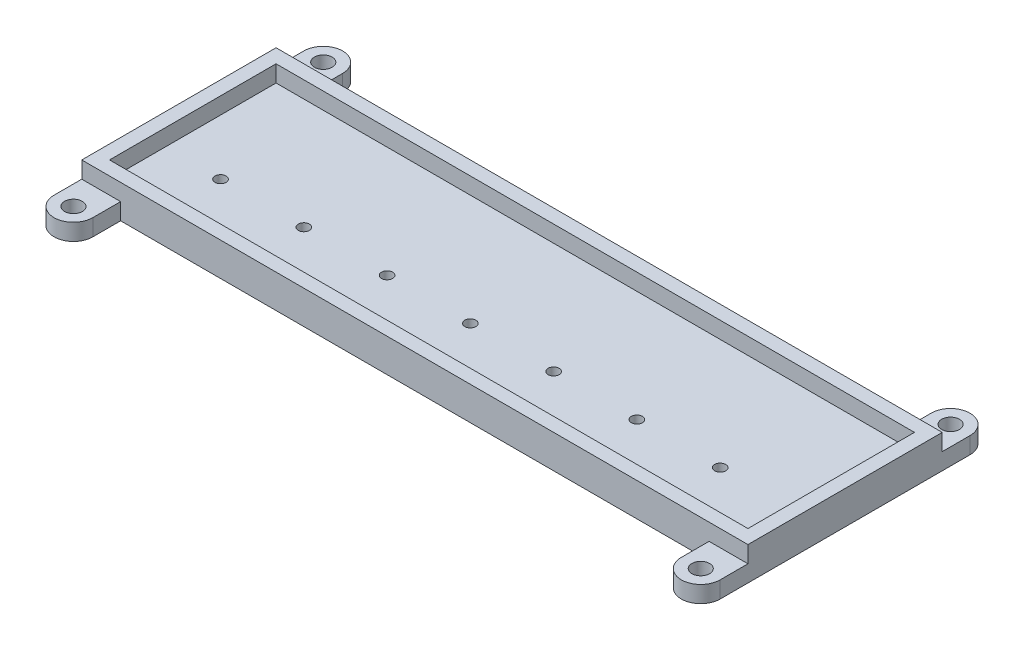
ISO-10303-21;
HEADER;
FILE_DESCRIPTION(('STEP AP214'),'2;1');
FILE_NAME('part.step','',(''),(''),'','','');
FILE_SCHEMA(('AUTOMOTIVE_DESIGN { 1 0 10303 214 1 1 1 1 }'));
ENDSEC;
DATA;
#1=APPLICATION_CONTEXT('core data for automotive mechanical design processes');
#2=APPLICATION_PROTOCOL_DEFINITION('international standard','automotive_design',2000,#1);
#3=PRODUCT_CONTEXT('',#1,'mechanical');
#4=PRODUCT('Part','Part','',(#3));
#5=PRODUCT_RELATED_PRODUCT_CATEGORY('part','',(#4));
#6=PRODUCT_DEFINITION_FORMATION('','',#4);
#7=PRODUCT_DEFINITION_CONTEXT('part definition',#1,'design');
#8=PRODUCT_DEFINITION('design','',#6,#7);
#9=PRODUCT_DEFINITION_SHAPE('','',#8);
#10=(LENGTH_UNIT() NAMED_UNIT(*) SI_UNIT(.MILLI.,.METRE.));
#11=(NAMED_UNIT(*) PLANE_ANGLE_UNIT() SI_UNIT($,.RADIAN.));
#12=(NAMED_UNIT(*) SI_UNIT($,.STERADIAN.) SOLID_ANGLE_UNIT());
#13=UNCERTAINTY_MEASURE_WITH_UNIT(LENGTH_MEASURE(1.E-05),#10,'distance_accuracy_value','');
#14=(GEOMETRIC_REPRESENTATION_CONTEXT(3) GLOBAL_UNCERTAINTY_ASSIGNED_CONTEXT((#13)) GLOBAL_UNIT_ASSIGNED_CONTEXT((#10,
#11,#12)) REPRESENTATION_CONTEXT('',''));
#15=CARTESIAN_POINT('',(0.,0.,0.));
#16=DIRECTION('',(0.,0.,1.));
#17=DIRECTION('',(1.,0.,0.));
#18=AXIS2_PLACEMENT_3D('',#15,#16,#17);
#19=CARTESIAN_POINT('',(117.5,134.,-32.5));
#20=DIRECTION('',(0.,0.,1.));
#21=DIRECTION('',(1.,0.,0.));
#22=AXIS2_PLACEMENT_3D('',#19,#20,#21);
#23=PLANE('',#22);
#24=DIRECTION('',(0.,-1.,0.));
#25=VECTOR('',#24,1.);
#26=CARTESIAN_POINT('',(117.5,134.,-32.5));
#27=LINE('',#26,#25);
#28=CARTESIAN_POINT('',(117.5,6.00000000000001,-32.5));
#29=VERTEX_POINT('',#28);
#30=CARTESIAN_POINT('',(117.5,3.,-32.5));
#31=VERTEX_POINT('',#30);
#32=EDGE_CURVE('E321',#29,#31,#27,.T.);
#33=ORIENTED_EDGE('',*,*,#32,.T.);
#34=DIRECTION('',(1.,0.,0.));
#35=VECTOR('',#34,1.);
#36=CARTESIAN_POINT('',(110.5,3.,-32.5));
#37=LINE('',#36,#35);
#38=CARTESIAN_POINT('',(110.5,3.,-32.5));
#39=VERTEX_POINT('',#38);
#40=EDGE_CURVE('E210',#39,#31,#37,.T.);
#41=ORIENTED_EDGE('',*,*,#40,.F.);
#42=DIRECTION('',(0.,-1.,0.));
#43=VECTOR('',#42,1.);
#44=CARTESIAN_POINT('',(110.5,3.,-32.5));
#45=LINE('',#44,#43);
#46=CARTESIAN_POINT('',(110.5,0.,-32.5));
#47=VERTEX_POINT('',#46);
#48=EDGE_CURVE('E221',#39,#47,#45,.T.);
#49=ORIENTED_EDGE('',*,*,#48,.T.);
#50=DIRECTION('',(-1.,0.,0.));
#51=VECTOR('',#50,1.);
#52=CARTESIAN_POINT('',(117.5,0.,-32.5));
#53=LINE('',#52,#51);
#54=CARTESIAN_POINT('',(4.5,0.,-32.5));
#55=VERTEX_POINT('',#54);
#56=EDGE_CURVE('E318',#47,#55,#53,.T.);
#57=ORIENTED_EDGE('',*,*,#56,.T.);
#58=DIRECTION('',(0.,-1.,0.));
#59=VECTOR('',#58,1.);
#60=CARTESIAN_POINT('',(4.5,3.,-32.5));
#61=LINE('',#60,#59);
#62=CARTESIAN_POINT('',(4.5,3.,-32.5));
#63=VERTEX_POINT('',#62);
#64=EDGE_CURVE('E262',#63,#55,#61,.T.);
#65=ORIENTED_EDGE('',*,*,#64,.F.);
#66=DIRECTION('',(-1.,0.,0.));
#67=VECTOR('',#66,1.);
#68=CARTESIAN_POINT('',(4.5,3.,-32.5));
#69=LINE('',#68,#67);
#70=CARTESIAN_POINT('',(-2.5,3.,-32.5));
#71=VERTEX_POINT('',#70);
#72=EDGE_CURVE('E240',#63,#71,#69,.T.);
#73=ORIENTED_EDGE('',*,*,#72,.T.);
#74=DIRECTION('',(0.,-1.,0.));
#75=VECTOR('',#74,1.);
#76=CARTESIAN_POINT('',(-2.5,134.,-32.5));
#77=LINE('',#76,#75);
#78=CARTESIAN_POINT('',(-2.5,6.00000000000001,-32.5));
#79=VERTEX_POINT('',#78);
#80=EDGE_CURVE('E317',#79,#71,#77,.T.);
#81=ORIENTED_EDGE('',*,*,#80,.F.);
#82=DIRECTION('',(1.,0.,0.));
#83=VECTOR('',#82,1.);
#84=CARTESIAN_POINT('',(117.5,6.00000000000001,-32.5));
#85=LINE('',#84,#83);
#86=EDGE_CURVE('E305',#79,#29,#85,.T.);
#87=ORIENTED_EDGE('',*,*,#86,.T.);
#88=EDGE_LOOP('',(#33,#41,#49,#57,#65,#73,#81,#87));
#89=FACE_BOUND('',#88,.T.);
#90=ADVANCED_FACE('F35',(#89),#23,.F.);
#91=CARTESIAN_POINT('',(-2.5,134.,2.5));
#92=DIRECTION('',(0.,0.,-1.));
#93=DIRECTION('',(-1.,0.,0.));
#94=AXIS2_PLACEMENT_3D('',#91,#92,#93);
#95=PLANE('',#94);
#96=DIRECTION('',(1.,0.,0.));
#97=VECTOR('',#96,1.);
#98=CARTESIAN_POINT('',(-2.5,0.,2.5));
#99=LINE('',#98,#97);
#100=CARTESIAN_POINT('',(4.5,0.,2.5));
#101=VERTEX_POINT('',#100);
#102=CARTESIAN_POINT('',(110.5,0.,2.5));
#103=VERTEX_POINT('',#102);
#104=EDGE_CURVE('E310',#101,#103,#99,.T.);
#105=ORIENTED_EDGE('',*,*,#104,.T.);
#106=DIRECTION('',(0.,-1.,0.));
#107=VECTOR('',#106,1.);
#108=CARTESIAN_POINT('',(110.5,3.,2.5));
#109=LINE('',#108,#107);
#110=CARTESIAN_POINT('',(110.5,3.,2.5));
#111=VERTEX_POINT('',#110);
#112=EDGE_CURVE('E50',#111,#103,#109,.T.);
#113=ORIENTED_EDGE('',*,*,#112,.F.);
#114=DIRECTION('',(1.,0.,0.));
#115=VECTOR('',#114,1.);
#116=CARTESIAN_POINT('',(110.5,3.,2.5));
#117=LINE('',#116,#115);
#118=CARTESIAN_POINT('',(117.5,3.,2.5));
#119=VERTEX_POINT('',#118);
#120=EDGE_CURVE('E54',#111,#119,#117,.T.);
#121=ORIENTED_EDGE('',*,*,#120,.T.);
#122=DIRECTION('',(0.,-1.,0.));
#123=VECTOR('',#122,1.);
#124=CARTESIAN_POINT('',(117.5,134.,2.5));
#125=LINE('',#124,#123);
#126=CARTESIAN_POINT('',(117.5,6.00000000000001,2.5));
#127=VERTEX_POINT('',#126);
#128=EDGE_CURVE('E309',#127,#119,#125,.T.);
#129=ORIENTED_EDGE('',*,*,#128,.F.);
#130=DIRECTION('',(-1.,0.,0.));
#131=VECTOR('',#130,1.);
#132=CARTESIAN_POINT('',(-2.5,6.00000000000001,2.5));
#133=LINE('',#132,#131);
#134=CARTESIAN_POINT('',(-2.5,6.00000000000001,2.5));
#135=VERTEX_POINT('',#134);
#136=EDGE_CURVE('E316',#127,#135,#133,.T.);
#137=ORIENTED_EDGE('',*,*,#136,.T.);
#138=DIRECTION('',(0.,-1.,0.));
#139=VECTOR('',#138,1.);
#140=CARTESIAN_POINT('',(-2.5,134.,2.5));
#141=LINE('',#140,#139);
#142=CARTESIAN_POINT('',(-2.5,3.,2.5));
#143=VERTEX_POINT('',#142);
#144=EDGE_CURVE('E313',#135,#143,#141,.T.);
#145=ORIENTED_EDGE('',*,*,#144,.T.);
#146=DIRECTION('',(-1.,0.,0.));
#147=VECTOR('',#146,1.);
#148=CARTESIAN_POINT('',(4.5,3.,2.5));
#149=LINE('',#148,#147);
#150=CARTESIAN_POINT('',(4.5,3.,2.5));
#151=VERTEX_POINT('',#150);
#152=EDGE_CURVE('E272',#151,#143,#149,.T.);
#153=ORIENTED_EDGE('',*,*,#152,.F.);
#154=DIRECTION('',(0.,-1.,0.));
#155=VECTOR('',#154,1.);
#156=CARTESIAN_POINT('',(4.5,3.,2.5));
#157=LINE('',#156,#155);
#158=EDGE_CURVE('E282',#151,#101,#157,.T.);
#159=ORIENTED_EDGE('',*,*,#158,.T.);
#160=EDGE_LOOP('',(#105,#113,#121,#129,#137,#145,#153,#159));
#161=FACE_BOUND('',#160,.T.);
#162=ADVANCED_FACE('F398',(#161),#95,.F.);
#163=CARTESIAN_POINT('',(100.,0.,-10.));
#164=DIRECTION('',(0.,1.,0.));
#165=DIRECTION('',(0.,0.,1.));
#166=AXIS2_PLACEMENT_3D('',#163,#164,#165);
#167=CYLINDRICAL_SURFACE('',#166,1.);
#168=CARTESIAN_POINT('',(100.,0.,-10.));
#169=DIRECTION('',(0.,1.,0.));
#170=DIRECTION('',(0.,0.,1.));
#171=AXIS2_PLACEMENT_3D('',#168,#169,#170);
#172=CIRCLE('',#171,1.);
#173=CARTESIAN_POINT('',(100.,0.,-9.));
#174=VERTEX_POINT('',#173);
#175=EDGE_CURVE('E43',#174,#174,#172,.T.);
#176=ORIENTED_EDGE('',*,*,#175,.F.);
#177=EDGE_LOOP('',(#176));
#178=FACE_BOUND('',#177,.T.);
#179=CARTESIAN_POINT('',(100.,3.,-10.));
#180=DIRECTION('',(0.,-1.,0.));
#181=DIRECTION('',(0.,0.,-1.));
#182=AXIS2_PLACEMENT_3D('',#179,#180,#181);
#183=CIRCLE('',#182,1.);
#184=CARTESIAN_POINT('',(100.,3.,-11.));
#185=VERTEX_POINT('',#184);
#186=EDGE_CURVE('E12',#185,#185,#183,.T.);
#187=ORIENTED_EDGE('',*,*,#186,.F.);
#188=EDGE_LOOP('',(#187));
#189=FACE_BOUND('',#188,.T.);
#190=ADVANCED_FACE('F37',(#178,#189),#167,.F.);
#191=CARTESIAN_POINT('',(85.,0.,-10.));
#192=DIRECTION('',(0.,1.,0.));
#193=DIRECTION('',(0.,0.,1.));
#194=AXIS2_PLACEMENT_3D('',#191,#192,#193);
#195=CYLINDRICAL_SURFACE('',#194,1.);
#196=CARTESIAN_POINT('',(85.,0.,-10.));
#197=DIRECTION('',(0.,1.,0.));
#198=DIRECTION('',(0.,0.,1.));
#199=AXIS2_PLACEMENT_3D('',#196,#197,#198);
#200=CIRCLE('',#199,1.);
#201=CARTESIAN_POINT('',(85.,0.,-9.));
#202=VERTEX_POINT('',#201);
#203=EDGE_CURVE('E384',#202,#202,#200,.T.);
#204=ORIENTED_EDGE('',*,*,#203,.F.);
#205=EDGE_LOOP('',(#204));
#206=FACE_BOUND('',#205,.T.);
#207=CARTESIAN_POINT('',(85.,3.,-10.));
#208=DIRECTION('',(0.,-1.,0.));
#209=DIRECTION('',(0.,0.,-1.));
#210=AXIS2_PLACEMENT_3D('',#207,#208,#209);
#211=CIRCLE('',#210,1.);
#212=CARTESIAN_POINT('',(85.,3.,-11.));
#213=VERTEX_POINT('',#212);
#214=EDGE_CURVE('E387',#213,#213,#211,.T.);
#215=ORIENTED_EDGE('',*,*,#214,.F.);
#216=EDGE_LOOP('',(#215));
#217=FACE_BOUND('',#216,.T.);
#218=ADVANCED_FACE('F397',(#206,#217),#195,.F.);
#219=CARTESIAN_POINT('',(70.,0.,-10.));
#220=DIRECTION('',(0.,1.,0.));
#221=DIRECTION('',(0.,0.,1.));
#222=AXIS2_PLACEMENT_3D('',#219,#220,#221);
#223=CYLINDRICAL_SURFACE('',#222,1.);
#224=CARTESIAN_POINT('',(70.,0.,-10.));
#225=DIRECTION('',(0.,1.,0.));
#226=DIRECTION('',(0.,0.,1.));
#227=AXIS2_PLACEMENT_3D('',#224,#225,#226);
#228=CIRCLE('',#227,1.);
#229=CARTESIAN_POINT('',(70.,0.,-9.));
#230=VERTEX_POINT('',#229);
#231=EDGE_CURVE('E378',#230,#230,#228,.T.);
#232=ORIENTED_EDGE('',*,*,#231,.F.);
#233=EDGE_LOOP('',(#232));
#234=FACE_BOUND('',#233,.T.);
#235=CARTESIAN_POINT('',(70.,3.,-10.));
#236=DIRECTION('',(0.,-1.,0.));
#237=DIRECTION('',(0.,0.,-1.));
#238=AXIS2_PLACEMENT_3D('',#235,#236,#237);
#239=CIRCLE('',#238,1.);
#240=CARTESIAN_POINT('',(70.,3.,-11.));
#241=VERTEX_POINT('',#240);
#242=EDGE_CURVE('E381',#241,#241,#239,.T.);
#243=ORIENTED_EDGE('',*,*,#242,.F.);
#244=EDGE_LOOP('',(#243));
#245=FACE_BOUND('',#244,.T.);
#246=ADVANCED_FACE('F558',(#234,#245),#223,.F.);
#247=CARTESIAN_POINT('',(55.,0.,-10.));
#248=DIRECTION('',(0.,1.,0.));
#249=DIRECTION('',(0.,0.,1.));
#250=AXIS2_PLACEMENT_3D('',#247,#248,#249);
#251=CYLINDRICAL_SURFACE('',#250,1.);
#252=CARTESIAN_POINT('',(55.,0.,-10.));
#253=DIRECTION('',(0.,1.,0.));
#254=DIRECTION('',(0.,0.,1.));
#255=AXIS2_PLACEMENT_3D('',#252,#253,#254);
#256=CIRCLE('',#255,1.);
#257=CARTESIAN_POINT('',(55.,0.,-9.));
#258=VERTEX_POINT('',#257);
#259=EDGE_CURVE('E372',#258,#258,#256,.T.);
#260=ORIENTED_EDGE('',*,*,#259,.F.);
#261=EDGE_LOOP('',(#260));
#262=FACE_BOUND('',#261,.T.);
#263=CARTESIAN_POINT('',(55.,3.,-10.));
#264=DIRECTION('',(0.,-1.,0.));
#265=DIRECTION('',(0.,0.,-1.));
#266=AXIS2_PLACEMENT_3D('',#263,#264,#265);
#267=CIRCLE('',#266,1.);
#268=CARTESIAN_POINT('',(55.,3.,-11.));
#269=VERTEX_POINT('',#268);
#270=EDGE_CURVE('E375',#269,#269,#267,.T.);
#271=ORIENTED_EDGE('',*,*,#270,.F.);
#272=EDGE_LOOP('',(#271));
#273=FACE_BOUND('',#272,.T.);
#274=ADVANCED_FACE('F414',(#262,#273),#251,.F.);
#275=CARTESIAN_POINT('',(40.,0.,-10.));
#276=DIRECTION('',(0.,1.,0.));
#277=DIRECTION('',(0.,0.,1.));
#278=AXIS2_PLACEMENT_3D('',#275,#276,#277);
#279=CYLINDRICAL_SURFACE('',#278,1.);
#280=CARTESIAN_POINT('',(40.,0.,-10.));
#281=DIRECTION('',(0.,1.,0.));
#282=DIRECTION('',(0.,0.,1.));
#283=AXIS2_PLACEMENT_3D('',#280,#281,#282);
#284=CIRCLE('',#283,1.);
#285=CARTESIAN_POINT('',(40.,0.,-9.));
#286=VERTEX_POINT('',#285);
#287=EDGE_CURVE('E366',#286,#286,#284,.T.);
#288=ORIENTED_EDGE('',*,*,#287,.F.);
#289=EDGE_LOOP('',(#288));
#290=FACE_BOUND('',#289,.T.);
#291=CARTESIAN_POINT('',(40.,3.,-10.));
#292=DIRECTION('',(0.,-1.,0.));
#293=DIRECTION('',(0.,0.,-1.));
#294=AXIS2_PLACEMENT_3D('',#291,#292,#293);
#295=CIRCLE('',#294,1.);
#296=CARTESIAN_POINT('',(40.,3.,-11.));
#297=VERTEX_POINT('',#296);
#298=EDGE_CURVE('E369',#297,#297,#295,.T.);
#299=ORIENTED_EDGE('',*,*,#298,.F.);
#300=EDGE_LOOP('',(#299));
#301=FACE_BOUND('',#300,.T.);
#302=ADVANCED_FACE('F404',(#290,#301),#279,.F.);
#303=CARTESIAN_POINT('',(0.,3.,0.));
#304=DIRECTION('',(0.,-1.,0.));
#305=DIRECTION('',(0.,0.,-1.));
#306=AXIS2_PLACEMENT_3D('',#303,#304,#305);
#307=PLANE('',#306);
#308=CARTESIAN_POINT('',(25.,3.,-10.));
#309=DIRECTION('',(0.,-1.,0.));
#310=DIRECTION('',(0.,0.,-1.));
#311=AXIS2_PLACEMENT_3D('',#308,#309,#310);
#312=CIRCLE('',#311,1.);
#313=CARTESIAN_POINT('',(25.,3.,-11.));
#314=VERTEX_POINT('',#313);
#315=EDGE_CURVE('E296',#314,#314,#312,.T.);
#316=ORIENTED_EDGE('',*,*,#315,.T.);
#317=EDGE_LOOP('',(#316));
#318=FACE_BOUND('',#317,.T.);
#319=CARTESIAN_POINT('',(10.,3.,-10.));
#320=DIRECTION('',(0.,-1.,0.));
#321=DIRECTION('',(0.,0.,-1.));
#322=AXIS2_PLACEMENT_3D('',#319,#320,#321);
#323=CIRCLE('',#322,1.);
#324=CARTESIAN_POINT('',(10.,3.,-11.));
#325=VERTEX_POINT('',#324);
#326=EDGE_CURVE('E302',#325,#325,#323,.T.);
#327=ORIENTED_EDGE('',*,*,#326,.T.);
#328=EDGE_LOOP('',(#327));
#329=FACE_BOUND('',#328,.T.);
#330=DIRECTION('',(0.,0.,1.));
#331=VECTOR('',#330,1.);
#332=CARTESIAN_POINT('',(0.,3.,0.));
#333=LINE('',#332,#331);
#334=CARTESIAN_POINT('',(0.,3.,-30.));
#335=VERTEX_POINT('',#334);
#336=CARTESIAN_POINT('',(0.,3.,0.));
#337=VERTEX_POINT('',#336);
#338=EDGE_CURVE('E353',#335,#337,#333,.T.);
#339=ORIENTED_EDGE('',*,*,#338,.T.);
#340=DIRECTION('',(1.,0.,0.));
#341=VECTOR('',#340,1.);
#342=CARTESIAN_POINT('',(0.,3.,0.));
#343=LINE('',#342,#341);
#344=CARTESIAN_POINT('',(115.,3.,0.));
#345=VERTEX_POINT('',#344);
#346=EDGE_CURVE('E357',#337,#345,#343,.T.);
#347=ORIENTED_EDGE('',*,*,#346,.T.);
#348=DIRECTION('',(0.,0.,-1.));
#349=VECTOR('',#348,1.);
#350=CARTESIAN_POINT('',(115.,3.,0.));
#351=LINE('',#350,#349);
#352=CARTESIAN_POINT('',(115.,3.,-30.));
#353=VERTEX_POINT('',#352);
#354=EDGE_CURVE('E360',#345,#353,#351,.T.);
#355=ORIENTED_EDGE('',*,*,#354,.T.);
#356=DIRECTION('',(-1.,0.,0.));
#357=VECTOR('',#356,1.);
#358=CARTESIAN_POINT('',(0.,3.,-30.));
#359=LINE('',#358,#357);
#360=EDGE_CURVE('E363',#353,#335,#359,.T.);
#361=ORIENTED_EDGE('',*,*,#360,.T.);
#362=EDGE_LOOP('',(#339,#347,#355,#361));
#363=FACE_BOUND('',#362,.T.);
#364=ORIENTED_EDGE('',*,*,#298,.T.);
#365=EDGE_LOOP('',(#364));
#366=FACE_BOUND('',#365,.T.);
#367=ORIENTED_EDGE('',*,*,#270,.T.);
#368=EDGE_LOOP('',(#367));
#369=FACE_BOUND('',#368,.T.);
#370=ORIENTED_EDGE('',*,*,#242,.T.);
#371=EDGE_LOOP('',(#370));
#372=FACE_BOUND('',#371,.T.);
#373=ORIENTED_EDGE('',*,*,#214,.T.);
#374=EDGE_LOOP('',(#373));
#375=FACE_BOUND('',#374,.T.);
#376=ORIENTED_EDGE('',*,*,#186,.T.);
#377=EDGE_LOOP('',(#376));
#378=FACE_BOUND('',#377,.T.);
#379=ADVANCED_FACE('F401',(#318,#329,#363,#366,#369,#372,#375,#378),#307,.F.);
#380=CARTESIAN_POINT('',(115.,134.,-30.));
#381=DIRECTION('',(0.,0.,1.));
#382=DIRECTION('',(1.,0.,0.));
#383=AXIS2_PLACEMENT_3D('',#380,#381,#382);
#384=PLANE('',#383);
#385=ORIENTED_EDGE('',*,*,#360,.F.);
#386=DIRECTION('',(0.,-1.,0.));
#387=VECTOR('',#386,1.);
#388=CARTESIAN_POINT('',(115.,134.,-30.));
#389=LINE('',#388,#387);
#390=CARTESIAN_POINT('',(115.,6.00000000000001,-30.));
#391=VERTEX_POINT('',#390);
#392=EDGE_CURVE('E340',#391,#353,#389,.T.);
#393=ORIENTED_EDGE('',*,*,#392,.F.);
#394=DIRECTION('',(1.,0.,0.));
#395=VECTOR('',#394,1.);
#396=CARTESIAN_POINT('',(115.,6.00000000000001,-30.));
#397=LINE('',#396,#395);
#398=CARTESIAN_POINT('',(0.,6.00000000000001,-30.));
#399=VERTEX_POINT('',#398);
#400=EDGE_CURVE('E325',#399,#391,#397,.T.);
#401=ORIENTED_EDGE('',*,*,#400,.F.);
#402=DIRECTION('',(0.,-1.,0.));
#403=VECTOR('',#402,1.);
#404=CARTESIAN_POINT('',(0.,134.,-30.));
#405=LINE('',#404,#403);
#406=EDGE_CURVE('E308',#399,#335,#405,.T.);
#407=ORIENTED_EDGE('',*,*,#406,.T.);
#408=EDGE_LOOP('',(#385,#393,#401,#407));
#409=FACE_BOUND('',#408,.T.);
#410=ADVANCED_FACE('F403',(#409),#384,.T.);
#411=CARTESIAN_POINT('',(0.,134.,-30.));
#412=DIRECTION('',(1.,0.,0.));
#413=DIRECTION('',(0.,0.,-1.));
#414=AXIS2_PLACEMENT_3D('',#411,#412,#413);
#415=PLANE('',#414);
#416=ORIENTED_EDGE('',*,*,#338,.F.);
#417=ORIENTED_EDGE('',*,*,#406,.F.);
#418=DIRECTION('',(0.,0.,-1.));
#419=VECTOR('',#418,1.);
#420=CARTESIAN_POINT('',(0.,6.00000000000001,-30.));
#421=LINE('',#420,#419);
#422=CARTESIAN_POINT('',(0.,6.00000000000001,0.));
#423=VERTEX_POINT('',#422);
#424=EDGE_CURVE('E351',#423,#399,#421,.T.);
#425=ORIENTED_EDGE('',*,*,#424,.F.);
#426=DIRECTION('',(0.,-1.,0.));
#427=VECTOR('',#426,1.);
#428=CARTESIAN_POINT('',(0.,134.,0.));
#429=LINE('',#428,#427);
#430=EDGE_CURVE('E334',#423,#337,#429,.T.);
#431=ORIENTED_EDGE('',*,*,#430,.T.);
#432=EDGE_LOOP('',(#416,#417,#425,#431));
#433=FACE_BOUND('',#432,.T.);
#434=ADVANCED_FACE('F411',(#433),#415,.T.);
#435=CARTESIAN_POINT('',(0.,134.,0.));
#436=DIRECTION('',(0.,0.,-1.));
#437=DIRECTION('',(-1.,0.,0.));
#438=AXIS2_PLACEMENT_3D('',#435,#436,#437);
#439=PLANE('',#438);
#440=ORIENTED_EDGE('',*,*,#346,.F.);
#441=ORIENTED_EDGE('',*,*,#430,.F.);
#442=DIRECTION('',(-1.,0.,0.));
#443=VECTOR('',#442,1.);
#444=CARTESIAN_POINT('',(0.,6.00000000000001,0.));
#445=LINE('',#444,#443);
#446=CARTESIAN_POINT('',(115.,6.00000000000001,0.));
#447=VERTEX_POINT('',#446);
#448=EDGE_CURVE('E324',#447,#423,#445,.T.);
#449=ORIENTED_EDGE('',*,*,#448,.F.);
#450=DIRECTION('',(0.,-1.,0.));
#451=VECTOR('',#450,1.);
#452=CARTESIAN_POINT('',(115.,134.,0.));
#453=LINE('',#452,#451);
#454=EDGE_CURVE('E337',#447,#345,#453,.T.);
#455=ORIENTED_EDGE('',*,*,#454,.T.);
#456=EDGE_LOOP('',(#440,#441,#449,#455));
#457=FACE_BOUND('',#456,.T.);
#458=ADVANCED_FACE('F433',(#457),#439,.T.);
#459=CARTESIAN_POINT('',(115.,134.,0.));
#460=DIRECTION('',(-1.,0.,0.));
#461=DIRECTION('',(0.,0.,1.));
#462=AXIS2_PLACEMENT_3D('',#459,#460,#461);
#463=PLANE('',#462);
#464=ORIENTED_EDGE('',*,*,#354,.F.);
#465=ORIENTED_EDGE('',*,*,#454,.F.);
#466=DIRECTION('',(0.,0.,1.));
#467=VECTOR('',#466,1.);
#468=CARTESIAN_POINT('',(115.,6.00000000000001,0.));
#469=LINE('',#468,#467);
#470=EDGE_CURVE('E322',#391,#447,#469,.T.);
#471=ORIENTED_EDGE('',*,*,#470,.F.);
#472=ORIENTED_EDGE('',*,*,#392,.T.);
#473=EDGE_LOOP('',(#464,#465,#471,#472));
#474=FACE_BOUND('',#473,.T.);
#475=ADVANCED_FACE('F430',(#474),#463,.T.);
#476=CARTESIAN_POINT('',(-2.5,134.,-32.5));
#477=DIRECTION('',(1.,0.,0.));
#478=DIRECTION('',(0.,0.,-1.));
#479=AXIS2_PLACEMENT_3D('',#476,#477,#478);
#480=PLANE('',#479);
#481=ORIENTED_EDGE('',*,*,#144,.F.);
#482=DIRECTION('',(0.,0.,-1.));
#483=VECTOR('',#482,1.);
#484=CARTESIAN_POINT('',(-2.5,6.00000000000001,-32.5));
#485=LINE('',#484,#483);
#486=EDGE_CURVE('E320',#135,#79,#485,.T.);
#487=ORIENTED_EDGE('',*,*,#486,.T.);
#488=ORIENTED_EDGE('',*,*,#80,.T.);
#489=DIRECTION('',(0.,0.,-1.));
#490=VECTOR('',#489,1.);
#491=CARTESIAN_POINT('',(-2.5,3.,-32.5));
#492=LINE('',#491,#490);
#493=CARTESIAN_POINT('',(-2.5,3.,-37.5));
#494=VERTEX_POINT('',#493);
#495=EDGE_CURVE('E250',#71,#494,#492,.T.);
#496=ORIENTED_EDGE('',*,*,#495,.T.);
#497=DIRECTION('',(0.,-1.,0.));
#498=VECTOR('',#497,1.);
#499=CARTESIAN_POINT('',(-2.5,3.,-37.5));
#500=LINE('',#499,#498);
#501=CARTESIAN_POINT('',(-2.5,0.,-37.5));
#502=VERTEX_POINT('',#501);
#503=EDGE_CURVE('E253',#494,#502,#500,.T.);
#504=ORIENTED_EDGE('',*,*,#503,.T.);
#505=DIRECTION('',(0.,0.,1.));
#506=VECTOR('',#505,1.);
#507=CARTESIAN_POINT('',(-2.5,0.,-32.5));
#508=LINE('',#507,#506);
#509=CARTESIAN_POINT('',(-2.5,0.,7.5));
#510=VERTEX_POINT('',#509);
#511=EDGE_CURVE('E314',#502,#510,#508,.T.);
#512=ORIENTED_EDGE('',*,*,#511,.T.);
#513=DIRECTION('',(0.,-1.,0.));
#514=VECTOR('',#513,1.);
#515=CARTESIAN_POINT('',(-2.5,3.,7.5));
#516=LINE('',#515,#514);
#517=CARTESIAN_POINT('',(-2.5,3.,7.5));
#518=VERTEX_POINT('',#517);
#519=EDGE_CURVE('E290',#518,#510,#516,.T.);
#520=ORIENTED_EDGE('',*,*,#519,.F.);
#521=DIRECTION('',(0.,0.,1.));
#522=VECTOR('',#521,1.);
#523=CARTESIAN_POINT('',(-2.5,3.,2.5));
#524=LINE('',#523,#522);
#525=EDGE_CURVE('E275',#143,#518,#524,.T.);
#526=ORIENTED_EDGE('',*,*,#525,.F.);
#527=EDGE_LOOP('',(#481,#487,#488,#496,#504,#512,#520,#526));
#528=FACE_BOUND('',#527,.T.);
#529=ADVANCED_FACE('F429',(#528),#480,.F.);
#530=CARTESIAN_POINT('',(117.5,134.,2.5));
#531=DIRECTION('',(-1.,0.,0.));
#532=DIRECTION('',(0.,0.,1.));
#533=AXIS2_PLACEMENT_3D('',#530,#531,#532);
#534=PLANE('',#533);
#535=ORIENTED_EDGE('',*,*,#32,.F.);
#536=DIRECTION('',(0.,0.,1.));
#537=VECTOR('',#536,1.);
#538=CARTESIAN_POINT('',(117.5,6.00000000000001,2.5));
#539=LINE('',#538,#537);
#540=EDGE_CURVE('E312',#29,#127,#539,.T.);
#541=ORIENTED_EDGE('',*,*,#540,.T.);
#542=ORIENTED_EDGE('',*,*,#128,.T.);
#543=DIRECTION('',(0.,0.,1.));
#544=VECTOR('',#543,1.);
#545=CARTESIAN_POINT('',(117.5,3.,2.5));
#546=LINE('',#545,#544);
#547=CARTESIAN_POINT('',(117.5,3.,7.5));
#548=VERTEX_POINT('',#547);
#549=EDGE_CURVE('E192',#119,#548,#546,.T.);
#550=ORIENTED_EDGE('',*,*,#549,.T.);
#551=DIRECTION('',(0.,-1.,0.));
#552=VECTOR('',#551,1.);
#553=CARTESIAN_POINT('',(117.5,3.,7.5));
#554=LINE('',#553,#552);
#555=CARTESIAN_POINT('',(117.5,0.,7.5));
#556=VERTEX_POINT('',#555);
#557=EDGE_CURVE('E181',#548,#556,#554,.T.);
#558=ORIENTED_EDGE('',*,*,#557,.T.);
#559=DIRECTION('',(0.,0.,-1.));
#560=VECTOR('',#559,1.);
#561=CARTESIAN_POINT('',(117.5,0.,2.5));
#562=LINE('',#561,#560);
#563=CARTESIAN_POINT('',(117.5,0.,-37.5));
#564=VERTEX_POINT('',#563);
#565=EDGE_CURVE('E306',#556,#564,#562,.T.);
#566=ORIENTED_EDGE('',*,*,#565,.T.);
#567=DIRECTION('',(0.,-1.,0.));
#568=VECTOR('',#567,1.);
#569=CARTESIAN_POINT('',(117.5,3.,-37.5));
#570=LINE('',#569,#568);
#571=CARTESIAN_POINT('',(117.5,3.,-37.5));
#572=VERTEX_POINT('',#571);
#573=EDGE_CURVE('E230',#572,#564,#570,.T.);
#574=ORIENTED_EDGE('',*,*,#573,.F.);
#575=DIRECTION('',(0.,0.,-1.));
#576=VECTOR('',#575,1.);
#577=CARTESIAN_POINT('',(117.5,3.,-32.5));
#578=LINE('',#577,#576);
#579=EDGE_CURVE('E213',#31,#572,#578,.T.);
#580=ORIENTED_EDGE('',*,*,#579,.F.);
#581=EDGE_LOOP('',(#535,#541,#542,#550,#558,#566,#574,#580));
#582=FACE_BOUND('',#581,.T.);
#583=ADVANCED_FACE('F442',(#582),#534,.F.);
#584=CARTESIAN_POINT('',(0.,6.,0.));
#585=DIRECTION('',(0.,-1.,0.));
#586=DIRECTION('',(0.,0.,-1.));
#587=AXIS2_PLACEMENT_3D('',#584,#585,#586);
#588=PLANE('',#587);
#589=ORIENTED_EDGE('',*,*,#400,.T.);
#590=ORIENTED_EDGE('',*,*,#470,.T.);
#591=ORIENTED_EDGE('',*,*,#448,.T.);
#592=ORIENTED_EDGE('',*,*,#424,.T.);
#593=EDGE_LOOP('',(#589,#590,#591,#592));
#594=FACE_BOUND('',#593,.T.);
#595=ORIENTED_EDGE('',*,*,#486,.F.);
#596=ORIENTED_EDGE('',*,*,#136,.F.);
#597=ORIENTED_EDGE('',*,*,#540,.F.);
#598=ORIENTED_EDGE('',*,*,#86,.F.);
#599=EDGE_LOOP('',(#595,#596,#597,#598));
#600=FACE_BOUND('',#599,.T.);
#601=ADVANCED_FACE('F440',(#594,#600),#588,.F.);
#602=CARTESIAN_POINT('',(0.,0.,0.));
#603=DIRECTION('',(0.,-1.,0.));
#604=DIRECTION('',(0.,0.,-1.));
#605=AXIS2_PLACEMENT_3D('',#602,#603,#604);
#606=PLANE('',#605);
#607=CARTESIAN_POINT('',(25.,0.,-10.));
#608=DIRECTION('',(0.,1.,0.));
#609=DIRECTION('',(0.,0.,1.));
#610=AXIS2_PLACEMENT_3D('',#607,#608,#609);
#611=CIRCLE('',#610,1.);
#612=CARTESIAN_POINT('',(25.,0.,-9.));
#613=VERTEX_POINT('',#612);
#614=EDGE_CURVE('E293',#613,#613,#611,.T.);
#615=ORIENTED_EDGE('',*,*,#614,.T.);
#616=EDGE_LOOP('',(#615));
#617=FACE_BOUND('',#616,.T.);
#618=CARTESIAN_POINT('',(10.,0.,-10.));
#619=DIRECTION('',(0.,1.,0.));
#620=DIRECTION('',(0.,0.,1.));
#621=AXIS2_PLACEMENT_3D('',#618,#619,#620);
#622=CIRCLE('',#621,1.);
#623=CARTESIAN_POINT('',(10.,0.,-9.));
#624=VERTEX_POINT('',#623);
#625=EDGE_CURVE('E299',#624,#624,#622,.T.);
#626=ORIENTED_EDGE('',*,*,#625,.T.);
#627=EDGE_LOOP('',(#626));
#628=FACE_BOUND('',#627,.T.);
#629=ORIENTED_EDGE('',*,*,#56,.F.);
#630=DIRECTION('',(0.,0.,1.));
#631=VECTOR('',#630,1.);
#632=CARTESIAN_POINT('',(110.5,0.,-32.5));
#633=LINE('',#632,#631);
#634=CARTESIAN_POINT('',(110.5,0.,-37.5));
#635=VERTEX_POINT('',#634);
#636=EDGE_CURVE('E214',#635,#47,#633,.T.);
#637=ORIENTED_EDGE('',*,*,#636,.F.);
#638=CARTESIAN_POINT('',(114.,0.,-37.5));
#639=DIRECTION('',(0.,1.,0.));
#640=DIRECTION('',(0.,0.,-1.));
#641=AXIS2_PLACEMENT_3D('',#638,#639,#640);
#642=CIRCLE('',#641,3.5);
#643=EDGE_CURVE('E207',#564,#635,#642,.T.);
#644=ORIENTED_EDGE('',*,*,#643,.F.);
#645=ORIENTED_EDGE('',*,*,#565,.F.);
#646=CARTESIAN_POINT('',(114.,0.,7.5));
#647=DIRECTION('',(0.,-1.,0.));
#648=DIRECTION('',(0.,0.,1.));
#649=AXIS2_PLACEMENT_3D('',#646,#647,#648);
#650=CIRCLE('',#649,3.5);
#651=CARTESIAN_POINT('',(110.5,0.,7.5));
#652=VERTEX_POINT('',#651);
#653=EDGE_CURVE('E198',#556,#652,#650,.T.);
#654=ORIENTED_EDGE('',*,*,#653,.T.);
#655=DIRECTION('',(0.,0.,-1.));
#656=VECTOR('',#655,1.);
#657=CARTESIAN_POINT('',(110.5,0.,2.5));
#658=LINE('',#657,#656);
#659=EDGE_CURVE('E176',#652,#103,#658,.T.);
#660=ORIENTED_EDGE('',*,*,#659,.T.);
#661=ORIENTED_EDGE('',*,*,#104,.F.);
#662=DIRECTION('',(0.,0.,-1.));
#663=VECTOR('',#662,1.);
#664=CARTESIAN_POINT('',(4.5,0.,2.5));
#665=LINE('',#664,#663);
#666=CARTESIAN_POINT('',(4.5,0.,7.5));
#667=VERTEX_POINT('',#666);
#668=EDGE_CURVE('E276',#667,#101,#665,.T.);
#669=ORIENTED_EDGE('',*,*,#668,.F.);
#670=CARTESIAN_POINT('',(1.,0.,7.5));
#671=DIRECTION('',(0.,1.,0.));
#672=DIRECTION('',(0.,0.,1.));
#673=AXIS2_PLACEMENT_3D('',#670,#671,#672);
#674=CIRCLE('',#673,3.5);
#675=EDGE_CURVE('E269',#510,#667,#674,.T.);
#676=ORIENTED_EDGE('',*,*,#675,.F.);
#677=ORIENTED_EDGE('',*,*,#511,.F.);
#678=CARTESIAN_POINT('',(1.,0.,-37.5));
#679=DIRECTION('',(0.,-1.,0.));
#680=DIRECTION('',(0.,0.,-1.));
#681=AXIS2_PLACEMENT_3D('',#678,#679,#680);
#682=CIRCLE('',#681,3.5);
#683=CARTESIAN_POINT('',(4.5,0.,-37.5));
#684=VERTEX_POINT('',#683);
#685=EDGE_CURVE('E244',#502,#684,#682,.T.);
#686=ORIENTED_EDGE('',*,*,#685,.T.);
#687=DIRECTION('',(0.,0.,1.));
#688=VECTOR('',#687,1.);
#689=CARTESIAN_POINT('',(4.5,0.,-32.5));
#690=LINE('',#689,#688);
#691=EDGE_CURVE('E237',#684,#55,#690,.T.);
#692=ORIENTED_EDGE('',*,*,#691,.T.);
#693=EDGE_LOOP('',(#629,#637,#644,#645,#654,#660,#661,#669,#676,#677,#686,#692));
#694=FACE_BOUND('',#693,.T.);
#695=ORIENTED_EDGE('',*,*,#287,.T.);
#696=EDGE_LOOP('',(#695));
#697=FACE_BOUND('',#696,.T.);
#698=ORIENTED_EDGE('',*,*,#259,.T.);
#699=EDGE_LOOP('',(#698));
#700=FACE_BOUND('',#699,.T.);
#701=ORIENTED_EDGE('',*,*,#231,.T.);
#702=EDGE_LOOP('',(#701));
#703=FACE_BOUND('',#702,.T.);
#704=ORIENTED_EDGE('',*,*,#203,.T.);
#705=EDGE_LOOP('',(#704));
#706=FACE_BOUND('',#705,.T.);
#707=ORIENTED_EDGE('',*,*,#175,.T.);
#708=EDGE_LOOP('',(#707));
#709=FACE_BOUND('',#708,.T.);
#710=CARTESIAN_POINT('',(1.,0.,7.5));
#711=DIRECTION('',(0.,1.,0.));
#712=DIRECTION('',(0.,0.,1.));
#713=AXIS2_PLACEMENT_3D('',#710,#711,#712);
#714=CIRCLE('',#713,1.6);
#715=CARTESIAN_POINT('',(1.,0.,9.1));
#716=VERTEX_POINT('',#715);
#717=EDGE_CURVE('E265',#716,#716,#714,.T.);
#718=ORIENTED_EDGE('',*,*,#717,.T.);
#719=EDGE_LOOP('',(#718));
#720=FACE_BOUND('',#719,.T.);
#721=CARTESIAN_POINT('',(1.,0.,-37.5));
#722=DIRECTION('',(0.,-1.,0.));
#723=DIRECTION('',(0.,0.,-1.));
#724=AXIS2_PLACEMENT_3D('',#721,#722,#723);
#725=CIRCLE('',#724,1.6);
#726=CARTESIAN_POINT('',(1.,0.,-39.1));
#727=VERTEX_POINT('',#726);
#728=EDGE_CURVE('E233',#727,#727,#725,.T.);
#729=ORIENTED_EDGE('',*,*,#728,.F.);
#730=EDGE_LOOP('',(#729));
#731=FACE_BOUND('',#730,.T.);
#732=CARTESIAN_POINT('',(114.,0.,-37.5));
#733=DIRECTION('',(0.,1.,0.));
#734=DIRECTION('',(0.,0.,-1.));
#735=AXIS2_PLACEMENT_3D('',#732,#733,#734);
#736=CIRCLE('',#735,1.6);
#737=CARTESIAN_POINT('',(114.,0.,-39.1));
#738=VERTEX_POINT('',#737);
#739=EDGE_CURVE('E203',#738,#738,#736,.T.);
#740=ORIENTED_EDGE('',*,*,#739,.T.);
#741=EDGE_LOOP('',(#740));
#742=FACE_BOUND('',#741,.T.);
#743=CARTESIAN_POINT('',(114.,0.,7.5));
#744=DIRECTION('',(0.,-1.,0.));
#745=DIRECTION('',(0.,0.,1.));
#746=AXIS2_PLACEMENT_3D('',#743,#744,#745);
#747=CIRCLE('',#746,1.6);
#748=CARTESIAN_POINT('',(114.,0.,9.1));
#749=VERTEX_POINT('',#748);
#750=EDGE_CURVE('E744',#749,#749,#747,.T.);
#751=ORIENTED_EDGE('',*,*,#750,.F.);
#752=EDGE_LOOP('',(#751));
#753=FACE_BOUND('',#752,.T.);
#754=ADVANCED_FACE('F392',(#617,#628,#694,#697,#700,#703,#706,#709,#720,#731,#742,#753),#606,.T.);
#755=CARTESIAN_POINT('',(10.,0.,-10.));
#756=DIRECTION('',(0.,1.,0.));
#757=DIRECTION('',(0.,0.,1.));
#758=AXIS2_PLACEMENT_3D('',#755,#756,#757);
#759=CYLINDRICAL_SURFACE('',#758,1.);
#760=ORIENTED_EDGE('',*,*,#625,.F.);
#761=EDGE_LOOP('',(#760));
#762=FACE_BOUND('',#761,.T.);
#763=ORIENTED_EDGE('',*,*,#326,.F.);
#764=EDGE_LOOP('',(#763));
#765=FACE_BOUND('',#764,.T.);
#766=ADVANCED_FACE('F448',(#762,#765),#759,.F.);
#767=CARTESIAN_POINT('',(25.,0.,-10.));
#768=DIRECTION('',(0.,1.,0.));
#769=DIRECTION('',(0.,0.,1.));
#770=AXIS2_PLACEMENT_3D('',#767,#768,#769);
#771=CYLINDRICAL_SURFACE('',#770,1.);
#772=ORIENTED_EDGE('',*,*,#614,.F.);
#773=EDGE_LOOP('',(#772));
#774=FACE_BOUND('',#773,.T.);
#775=ORIENTED_EDGE('',*,*,#315,.F.);
#776=EDGE_LOOP('',(#775));
#777=FACE_BOUND('',#776,.T.);
#778=ADVANCED_FACE('F532',(#774,#777),#771,.F.);
#779=CARTESIAN_POINT('',(1.,3.,7.5));
#780=DIRECTION('',(0.,1.,0.));
#781=DIRECTION('',(0.,0.,1.));
#782=AXIS2_PLACEMENT_3D('',#779,#780,#781);
#783=PLANE('',#782);
#784=ORIENTED_EDGE('',*,*,#152,.T.);
#785=ORIENTED_EDGE('',*,*,#525,.T.);
#786=CARTESIAN_POINT('',(1.,3.,7.5));
#787=DIRECTION('',(0.,1.,0.));
#788=DIRECTION('',(0.,0.,1.));
#789=AXIS2_PLACEMENT_3D('',#786,#787,#788);
#790=CIRCLE('',#789,3.5);
#791=CARTESIAN_POINT('',(4.5,3.,7.5));
#792=VERTEX_POINT('',#791);
#793=EDGE_CURVE('E278',#518,#792,#790,.T.);
#794=ORIENTED_EDGE('',*,*,#793,.T.);
#795=DIRECTION('',(0.,0.,-1.));
#796=VECTOR('',#795,1.);
#797=CARTESIAN_POINT('',(4.5,3.,2.5));
#798=LINE('',#797,#796);
#799=EDGE_CURVE('E280',#792,#151,#798,.T.);
#800=ORIENTED_EDGE('',*,*,#799,.T.);
#801=EDGE_LOOP('',(#784,#785,#794,#800));
#802=FACE_BOUND('',#801,.T.);
#803=CARTESIAN_POINT('',(1.,3.,7.5));
#804=DIRECTION('',(0.,1.,0.));
#805=DIRECTION('',(0.,0.,1.));
#806=AXIS2_PLACEMENT_3D('',#803,#804,#805);
#807=CIRCLE('',#806,1.6);
#808=CARTESIAN_POINT('',(1.,3.,9.1));
#809=VERTEX_POINT('',#808);
#810=EDGE_CURVE('E266',#809,#809,#807,.T.);
#811=ORIENTED_EDGE('',*,*,#810,.F.);
#812=EDGE_LOOP('',(#811));
#813=FACE_BOUND('',#812,.T.);
#814=ADVANCED_FACE('F481',(#802,#813),#783,.T.);
#815=CARTESIAN_POINT('',(1.,3.,7.5));
#816=DIRECTION('',(0.,-1.,0.));
#817=DIRECTION('',(0.,0.,-1.));
#818=AXIS2_PLACEMENT_3D('',#815,#816,#817);
#819=CYLINDRICAL_SURFACE('',#818,3.5);
#820=ORIENTED_EDGE('',*,*,#675,.T.);
#821=DIRECTION('',(0.,-1.,0.));
#822=VECTOR('',#821,1.);
#823=CARTESIAN_POINT('',(4.5,3.,7.5));
#824=LINE('',#823,#822);
#825=EDGE_CURVE('E287',#792,#667,#824,.T.);
#826=ORIENTED_EDGE('',*,*,#825,.F.);
#827=ORIENTED_EDGE('',*,*,#793,.F.);
#828=ORIENTED_EDGE('',*,*,#519,.T.);
#829=EDGE_LOOP('',(#820,#826,#827,#828));
#830=FACE_BOUND('',#829,.T.);
#831=ADVANCED_FACE('F477',(#830),#819,.T.);
#832=CARTESIAN_POINT('',(4.5,3.,2.5));
#833=DIRECTION('',(-1.,0.,0.));
#834=DIRECTION('',(0.,0.,1.));
#835=AXIS2_PLACEMENT_3D('',#832,#833,#834);
#836=PLANE('',#835);
#837=ORIENTED_EDGE('',*,*,#668,.T.);
#838=ORIENTED_EDGE('',*,*,#158,.F.);
#839=ORIENTED_EDGE('',*,*,#799,.F.);
#840=ORIENTED_EDGE('',*,*,#825,.T.);
#841=EDGE_LOOP('',(#837,#838,#839,#840));
#842=FACE_BOUND('',#841,.T.);
#843=ADVANCED_FACE('F528',(#842),#836,.F.);
#844=CARTESIAN_POINT('',(1.,3.,7.5));
#845=DIRECTION('',(0.,-1.,0.));
#846=DIRECTION('',(0.,0.,-1.));
#847=AXIS2_PLACEMENT_3D('',#844,#845,#846);
#848=CYLINDRICAL_SURFACE('',#847,1.6);
#849=ORIENTED_EDGE('',*,*,#810,.T.);
#850=EDGE_LOOP('',(#849));
#851=FACE_BOUND('',#850,.T.);
#852=ORIENTED_EDGE('',*,*,#717,.F.);
#853=EDGE_LOOP('',(#852));
#854=FACE_BOUND('',#853,.T.);
#855=ADVANCED_FACE('F524',(#851,#854),#848,.F.);
#856=CARTESIAN_POINT('',(4.5,3.,-32.5));
#857=DIRECTION('',(1.,0.,0.));
#858=DIRECTION('',(0.,0.,-1.));
#859=AXIS2_PLACEMENT_3D('',#856,#857,#858);
#860=PLANE('',#859);
#861=ORIENTED_EDGE('',*,*,#691,.F.);
#862=DIRECTION('',(0.,-1.,0.));
#863=VECTOR('',#862,1.);
#864=CARTESIAN_POINT('',(4.5,3.,-37.5));
#865=LINE('',#864,#863);
#866=CARTESIAN_POINT('',(4.5,3.,-37.5));
#867=VERTEX_POINT('',#866);
#868=EDGE_CURVE('E260',#867,#684,#865,.T.);
#869=ORIENTED_EDGE('',*,*,#868,.F.);
#870=DIRECTION('',(0.,0.,1.));
#871=VECTOR('',#870,1.);
#872=CARTESIAN_POINT('',(4.5,3.,-32.5));
#873=LINE('',#872,#871);
#874=EDGE_CURVE('E243',#867,#63,#873,.T.);
#875=ORIENTED_EDGE('',*,*,#874,.T.);
#876=ORIENTED_EDGE('',*,*,#64,.T.);
#877=EDGE_LOOP('',(#861,#869,#875,#876));
#878=FACE_BOUND('',#877,.T.);
#879=ADVANCED_FACE('F521',(#878),#860,.T.);
#880=CARTESIAN_POINT('',(1.,3.,-37.5));
#881=DIRECTION('',(0.,-1.,0.));
#882=DIRECTION('',(0.,0.,-1.));
#883=AXIS2_PLACEMENT_3D('',#880,#881,#882);
#884=CYLINDRICAL_SURFACE('',#883,3.5);
#885=ORIENTED_EDGE('',*,*,#685,.F.);
#886=ORIENTED_EDGE('',*,*,#503,.F.);
#887=CARTESIAN_POINT('',(1.,3.,-37.5));
#888=DIRECTION('',(0.,-1.,0.));
#889=DIRECTION('',(0.,0.,-1.));
#890=AXIS2_PLACEMENT_3D('',#887,#888,#889);
#891=CIRCLE('',#890,3.5);
#892=EDGE_CURVE('E247',#494,#867,#891,.T.);
#893=ORIENTED_EDGE('',*,*,#892,.T.);
#894=ORIENTED_EDGE('',*,*,#868,.T.);
#895=EDGE_LOOP('',(#885,#886,#893,#894));
#896=FACE_BOUND('',#895,.T.);
#897=ADVANCED_FACE('F469',(#896),#884,.T.);
#898=CARTESIAN_POINT('',(1.,3.,-37.5));
#899=DIRECTION('',(0.,1.,0.));
#900=DIRECTION('',(0.,0.,-1.));
#901=AXIS2_PLACEMENT_3D('',#898,#899,#900);
#902=PLANE('',#901);
#903=CARTESIAN_POINT('',(1.,3.,-37.5));
#904=DIRECTION('',(0.,-1.,0.));
#905=DIRECTION('',(0.,0.,-1.));
#906=AXIS2_PLACEMENT_3D('',#903,#904,#905);
#907=CIRCLE('',#906,1.6);
#908=CARTESIAN_POINT('',(1.,3.,-39.1));
#909=VERTEX_POINT('',#908);
#910=EDGE_CURVE('E234',#909,#909,#907,.T.);
#911=ORIENTED_EDGE('',*,*,#910,.T.);
#912=EDGE_LOOP('',(#911));
#913=FACE_BOUND('',#912,.T.);
#914=ORIENTED_EDGE('',*,*,#72,.F.);
#915=ORIENTED_EDGE('',*,*,#874,.F.);
#916=ORIENTED_EDGE('',*,*,#892,.F.);
#917=ORIENTED_EDGE('',*,*,#495,.F.);
#918=EDGE_LOOP('',(#914,#915,#916,#917));
#919=FACE_BOUND('',#918,.T.);
#920=ADVANCED_FACE('F466',(#913,#919),#902,.T.);
#921=CARTESIAN_POINT('',(1.,3.,-37.5));
#922=DIRECTION('',(0.,-1.,0.));
#923=DIRECTION('',(0.,0.,-1.));
#924=AXIS2_PLACEMENT_3D('',#921,#922,#923);
#925=CYLINDRICAL_SURFACE('',#924,1.6);
#926=ORIENTED_EDGE('',*,*,#910,.F.);
#927=EDGE_LOOP('',(#926));
#928=FACE_BOUND('',#927,.T.);
#929=ORIENTED_EDGE('',*,*,#728,.T.);
#930=EDGE_LOOP('',(#929));
#931=FACE_BOUND('',#930,.T.);
#932=ADVANCED_FACE('F512',(#928,#931),#925,.F.);
#933=CARTESIAN_POINT('',(114.,3.,-37.5));
#934=DIRECTION('',(0.,1.,0.));
#935=DIRECTION('',(0.,0.,-1.));
#936=AXIS2_PLACEMENT_3D('',#933,#934,#935);
#937=PLANE('',#936);
#938=ORIENTED_EDGE('',*,*,#40,.T.);
#939=ORIENTED_EDGE('',*,*,#579,.T.);
#940=CARTESIAN_POINT('',(114.,3.,-37.5));
#941=DIRECTION('',(0.,1.,0.));
#942=DIRECTION('',(0.,0.,-1.));
#943=AXIS2_PLACEMENT_3D('',#940,#941,#942);
#944=CIRCLE('',#943,3.5);
#945=CARTESIAN_POINT('',(110.5,3.,-37.5));
#946=VERTEX_POINT('',#945);
#947=EDGE_CURVE('E216',#572,#946,#944,.T.);
#948=ORIENTED_EDGE('',*,*,#947,.T.);
#949=DIRECTION('',(0.,0.,1.));
#950=VECTOR('',#949,1.);
#951=CARTESIAN_POINT('',(110.5,3.,-32.5));
#952=LINE('',#951,#950);
#953=EDGE_CURVE('E218',#946,#39,#952,.T.);
#954=ORIENTED_EDGE('',*,*,#953,.T.);
#955=EDGE_LOOP('',(#938,#939,#948,#954));
#956=FACE_BOUND('',#955,.T.);
#957=CARTESIAN_POINT('',(114.,3.,-37.5));
#958=DIRECTION('',(0.,1.,0.));
#959=DIRECTION('',(0.,0.,-1.));
#960=AXIS2_PLACEMENT_3D('',#957,#958,#959);
#961=CIRCLE('',#960,1.6);
#962=CARTESIAN_POINT('',(114.,3.,-39.1));
#963=VERTEX_POINT('',#962);
#964=EDGE_CURVE('E204',#963,#963,#961,.T.);
#965=ORIENTED_EDGE('',*,*,#964,.F.);
#966=EDGE_LOOP('',(#965));
#967=FACE_BOUND('',#966,.T.);
#968=ADVANCED_FACE('F495',(#956,#967),#937,.T.);
#969=CARTESIAN_POINT('',(114.,3.,-37.5));
#970=DIRECTION('',(0.,-1.,0.));
#971=DIRECTION('',(0.,0.,-1.));
#972=AXIS2_PLACEMENT_3D('',#969,#970,#971);
#973=CYLINDRICAL_SURFACE('',#972,3.5);
#974=ORIENTED_EDGE('',*,*,#643,.T.);
#975=DIRECTION('',(0.,-1.,0.));
#976=VECTOR('',#975,1.);
#977=CARTESIAN_POINT('',(110.5,3.,-37.5));
#978=LINE('',#977,#976);
#979=EDGE_CURVE('E227',#946,#635,#978,.T.);
#980=ORIENTED_EDGE('',*,*,#979,.F.);
#981=ORIENTED_EDGE('',*,*,#947,.F.);
#982=ORIENTED_EDGE('',*,*,#573,.T.);
#983=EDGE_LOOP('',(#974,#980,#981,#982));
#984=FACE_BOUND('',#983,.T.);
#985=ADVANCED_FACE('F491',(#984),#973,.T.);
#986=CARTESIAN_POINT('',(110.5,3.,-32.5));
#987=DIRECTION('',(1.,0.,0.));
#988=DIRECTION('',(0.,0.,-1.));
#989=AXIS2_PLACEMENT_3D('',#986,#987,#988);
#990=PLANE('',#989);
#991=ORIENTED_EDGE('',*,*,#636,.T.);
#992=ORIENTED_EDGE('',*,*,#48,.F.);
#993=ORIENTED_EDGE('',*,*,#953,.F.);
#994=ORIENTED_EDGE('',*,*,#979,.T.);
#995=EDGE_LOOP('',(#991,#992,#993,#994));
#996=FACE_BOUND('',#995,.T.);
#997=ADVANCED_FACE('F499',(#996),#990,.F.);
#998=CARTESIAN_POINT('',(114.,3.,-37.5));
#999=DIRECTION('',(0.,-1.,0.));
#1000=DIRECTION('',(0.,0.,-1.));
#1001=AXIS2_PLACEMENT_3D('',#998,#999,#1000);
#1002=CYLINDRICAL_SURFACE('',#1001,1.6);
#1003=ORIENTED_EDGE('',*,*,#964,.T.);
#1004=EDGE_LOOP('',(#1003));
#1005=FACE_BOUND('',#1004,.T.);
#1006=ORIENTED_EDGE('',*,*,#739,.F.);
#1007=EDGE_LOOP('',(#1006));
#1008=FACE_BOUND('',#1007,.T.);
#1009=ADVANCED_FACE('F501',(#1005,#1008),#1002,.F.);
#1010=CARTESIAN_POINT('',(110.5,3.,2.5));
#1011=DIRECTION('',(-1.,0.,0.));
#1012=DIRECTION('',(0.,0.,1.));
#1013=AXIS2_PLACEMENT_3D('',#1010,#1011,#1012);
#1014=PLANE('',#1013);
#1015=ORIENTED_EDGE('',*,*,#659,.F.);
#1016=DIRECTION('',(0.,-1.,0.));
#1017=VECTOR('',#1016,1.);
#1018=CARTESIAN_POINT('',(110.5,3.,7.5));
#1019=LINE('',#1018,#1017);
#1020=CARTESIAN_POINT('',(110.5,3.,7.5));
#1021=VERTEX_POINT('',#1020);
#1022=EDGE_CURVE('E171',#1021,#652,#1019,.T.);
#1023=ORIENTED_EDGE('',*,*,#1022,.F.);
#1024=DIRECTION('',(0.,0.,-1.));
#1025=VECTOR('',#1024,1.);
#1026=CARTESIAN_POINT('',(110.5,3.,2.5));
#1027=LINE('',#1026,#1025);
#1028=EDGE_CURVE('E174',#1021,#111,#1027,.T.);
#1029=ORIENTED_EDGE('',*,*,#1028,.T.);
#1030=ORIENTED_EDGE('',*,*,#112,.T.);
#1031=EDGE_LOOP('',(#1015,#1023,#1029,#1030));
#1032=FACE_BOUND('',#1031,.T.);
#1033=ADVANCED_FACE('F173',(#1032),#1014,.T.);
#1034=CARTESIAN_POINT('',(114.,3.,7.5));
#1035=DIRECTION('',(0.,-1.,0.));
#1036=DIRECTION('',(0.,0.,-1.));
#1037=AXIS2_PLACEMENT_3D('',#1034,#1035,#1036);
#1038=CYLINDRICAL_SURFACE('',#1037,3.5);
#1039=ORIENTED_EDGE('',*,*,#653,.F.);
#1040=ORIENTED_EDGE('',*,*,#557,.F.);
#1041=CARTESIAN_POINT('',(114.,3.,7.5));
#1042=DIRECTION('',(0.,-1.,0.));
#1043=DIRECTION('',(0.,0.,1.));
#1044=AXIS2_PLACEMENT_3D('',#1041,#1042,#1043);
#1045=CIRCLE('',#1044,3.5);
#1046=EDGE_CURVE('E187',#548,#1021,#1045,.T.);
#1047=ORIENTED_EDGE('',*,*,#1046,.T.);
#1048=ORIENTED_EDGE('',*,*,#1022,.T.);
#1049=EDGE_LOOP('',(#1039,#1040,#1047,#1048));
#1050=FACE_BOUND('',#1049,.T.);
#1051=ADVANCED_FACE('F190',(#1050),#1038,.T.);
#1052=CARTESIAN_POINT('',(114.,3.,7.5));
#1053=DIRECTION('',(0.,1.,0.));
#1054=DIRECTION('',(0.,0.,1.));
#1055=AXIS2_PLACEMENT_3D('',#1052,#1053,#1054);
#1056=PLANE('',#1055);
#1057=CARTESIAN_POINT('',(114.,3.,7.5));
#1058=DIRECTION('',(0.,-1.,0.));
#1059=DIRECTION('',(0.,0.,1.));
#1060=AXIS2_PLACEMENT_3D('',#1057,#1058,#1059);
#1061=CIRCLE('',#1060,1.6);
#1062=CARTESIAN_POINT('',(114.,3.,9.1));
#1063=VERTEX_POINT('',#1062);
#1064=EDGE_CURVE('E199',#1063,#1063,#1061,.T.);
#1065=ORIENTED_EDGE('',*,*,#1064,.T.);
#1066=EDGE_LOOP('',(#1065));
#1067=FACE_BOUND('',#1066,.T.);
#1068=ORIENTED_EDGE('',*,*,#120,.F.);
#1069=ORIENTED_EDGE('',*,*,#1028,.F.);
#1070=ORIENTED_EDGE('',*,*,#1046,.F.);
#1071=ORIENTED_EDGE('',*,*,#549,.F.);
#1072=EDGE_LOOP('',(#1068,#1069,#1070,#1071));
#1073=FACE_BOUND('',#1072,.T.);
#1074=ADVANCED_FACE('F185',(#1067,#1073),#1056,.T.);
#1075=CARTESIAN_POINT('',(114.,3.,7.5));
#1076=DIRECTION('',(0.,-1.,0.));
#1077=DIRECTION('',(0.,0.,-1.));
#1078=AXIS2_PLACEMENT_3D('',#1075,#1076,#1077);
#1079=CYLINDRICAL_SURFACE('',#1078,1.6);
#1080=ORIENTED_EDGE('',*,*,#1064,.F.);
#1081=EDGE_LOOP('',(#1080));
#1082=FACE_BOUND('',#1081,.T.);
#1083=ORIENTED_EDGE('',*,*,#750,.T.);
#1084=EDGE_LOOP('',(#1083));
#1085=FACE_BOUND('',#1084,.T.);
#1086=ADVANCED_FACE('F725',(#1082,#1085),#1079,.F.);
#1087=CLOSED_SHELL('',(#90,#162,#190,#218,#246,#274,#302,#379,#410,#434,#458,#475,#529,#583,
#601,#754,#766,#778,#814,#831,#843,#855,#879,#897,#920,#932,#968,#985,#997,#1009,#1033,#1051,
#1074,#1086));
#1088=MANIFOLD_SOLID_BREP('B2',#1087);
#1089=ADVANCED_BREP_SHAPE_REPRESENTATION('',(#18,#1088),#14);
#1090=SHAPE_DEFINITION_REPRESENTATION(#9,#1089);
ENDSEC;
END-ISO-10303-21;
